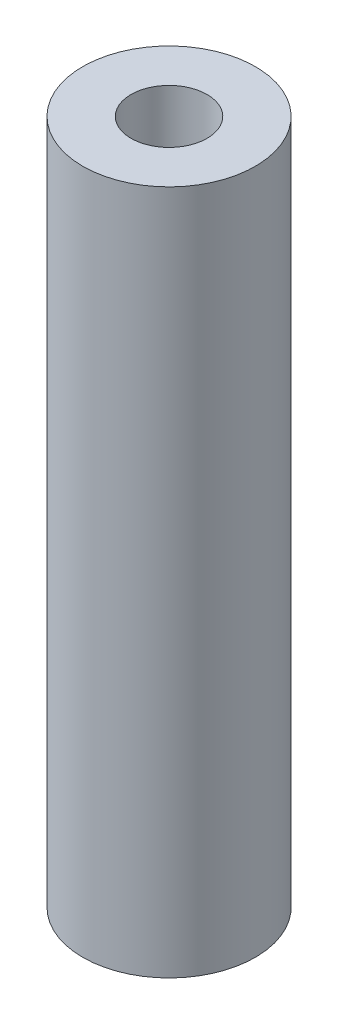
ISO-10303-21;
HEADER;
FILE_DESCRIPTION(('STEP AP214'),'2;1');
FILE_NAME('part.step','',(''),(''),'','','');
FILE_SCHEMA(('AUTOMOTIVE_DESIGN { 1 0 10303 214 1 1 1 1 }'));
ENDSEC;
DATA;
#1=APPLICATION_CONTEXT('core data for automotive mechanical design processes');
#2=APPLICATION_PROTOCOL_DEFINITION('international standard','automotive_design',2000,#1);
#3=PRODUCT_CONTEXT('',#1,'mechanical');
#4=PRODUCT('Part','Part','',(#3));
#5=PRODUCT_RELATED_PRODUCT_CATEGORY('part','',(#4));
#6=PRODUCT_DEFINITION_FORMATION('','',#4);
#7=PRODUCT_DEFINITION_CONTEXT('part definition',#1,'design');
#8=PRODUCT_DEFINITION('design','',#6,#7);
#9=PRODUCT_DEFINITION_SHAPE('','',#8);
#10=(LENGTH_UNIT() NAMED_UNIT(*) SI_UNIT(.MILLI.,.METRE.));
#11=(NAMED_UNIT(*) PLANE_ANGLE_UNIT() SI_UNIT($,.RADIAN.));
#12=(NAMED_UNIT(*) SI_UNIT($,.STERADIAN.) SOLID_ANGLE_UNIT());
#13=UNCERTAINTY_MEASURE_WITH_UNIT(LENGTH_MEASURE(1.E-05),#10,'distance_accuracy_value','');
#14=(GEOMETRIC_REPRESENTATION_CONTEXT(3) GLOBAL_UNCERTAINTY_ASSIGNED_CONTEXT((#13)) GLOBAL_UNIT_ASSIGNED_CONTEXT((#10,
#11,#12)) REPRESENTATION_CONTEXT('',''));
#15=CARTESIAN_POINT('',(0.,0.,0.));
#16=DIRECTION('',(0.,0.,1.));
#17=DIRECTION('',(1.,0.,0.));
#18=AXIS2_PLACEMENT_3D('',#15,#16,#17);
#19=CARTESIAN_POINT('',(0.,25.4,0.));
#20=DIRECTION('',(0.,-1.,0.));
#21=DIRECTION('',(0.,0.,-1.));
#22=AXIS2_PLACEMENT_3D('',#19,#20,#21);
#23=CYLINDRICAL_SURFACE('',#22,3.2004);
#24=CARTESIAN_POINT('',(0.,25.4,0.));
#25=DIRECTION('',(0.,1.,0.));
#26=DIRECTION('',(0.,0.,1.));
#27=AXIS2_PLACEMENT_3D('',#24,#25,#26);
#28=CIRCLE('',#27,3.2004);
#29=CARTESIAN_POINT('',(0.,25.4,3.2004));
#30=VERTEX_POINT('',#29);
#31=EDGE_CURVE('E10',#30,#30,#28,.T.);
#32=ORIENTED_EDGE('',*,*,#31,.F.);
#33=EDGE_LOOP('',(#32));
#34=FACE_BOUND('',#33,.T.);
#35=CARTESIAN_POINT('',(0.,0.,0.));
#36=DIRECTION('',(0.,1.,0.));
#37=DIRECTION('',(0.,0.,1.));
#38=AXIS2_PLACEMENT_3D('',#35,#36,#37);
#39=CIRCLE('',#38,3.2004);
#40=CARTESIAN_POINT('',(0.,0.,3.2004));
#41=VERTEX_POINT('',#40);
#42=EDGE_CURVE('E35',#41,#41,#39,.T.);
#43=ORIENTED_EDGE('',*,*,#42,.T.);
#44=EDGE_LOOP('',(#43));
#45=FACE_BOUND('',#44,.T.);
#46=ADVANCED_FACE('F32',(#34,#45),#23,.T.);
#47=CARTESIAN_POINT('',(0.,25.4,0.));
#48=DIRECTION('',(0.,1.,0.));
#49=DIRECTION('',(0.,0.,1.));
#50=AXIS2_PLACEMENT_3D('',#47,#48,#49);
#51=PLANE('',#50);
#52=CARTESIAN_POINT('',(0.,25.4,0.));
#53=DIRECTION('',(0.,-1.,0.));
#54=DIRECTION('',(0.,0.,-1.));
#55=AXIS2_PLACEMENT_3D('',#52,#53,#54);
#56=CIRCLE('',#55,1.40969999999999);
#57=CARTESIAN_POINT('',(0.,25.4,-1.40969999999999));
#58=VERTEX_POINT('',#57);
#59=EDGE_CURVE('E42',#58,#58,#56,.T.);
#60=ORIENTED_EDGE('',*,*,#59,.T.);
#61=EDGE_LOOP('',(#60));
#62=FACE_BOUND('',#61,.T.);
#63=ORIENTED_EDGE('',*,*,#31,.T.);
#64=EDGE_LOOP('',(#63));
#65=FACE_BOUND('',#64,.T.);
#66=ADVANCED_FACE('F55',(#62,#65),#51,.T.);
#67=CARTESIAN_POINT('',(0.,0.,0.));
#68=DIRECTION('',(0.,1.,0.));
#69=DIRECTION('',(0.,0.,1.));
#70=AXIS2_PLACEMENT_3D('',#67,#68,#69);
#71=PLANE('',#70);
#72=CARTESIAN_POINT('',(0.,0.,0.));
#73=DIRECTION('',(0.,-1.,0.));
#74=DIRECTION('',(0.,0.,-1.));
#75=AXIS2_PLACEMENT_3D('',#72,#73,#74);
#76=CIRCLE('',#75,1.40969999999999);
#77=CARTESIAN_POINT('',(0.,0.,-1.40969999999999));
#78=VERTEX_POINT('',#77);
#79=EDGE_CURVE('E46',#78,#78,#76,.T.);
#80=ORIENTED_EDGE('',*,*,#79,.F.);
#81=EDGE_LOOP('',(#80));
#82=FACE_BOUND('',#81,.T.);
#83=ORIENTED_EDGE('',*,*,#42,.F.);
#84=EDGE_LOOP('',(#83));
#85=FACE_BOUND('',#84,.T.);
#86=ADVANCED_FACE('F52',(#82,#85),#71,.F.);
#87=CARTESIAN_POINT('',(0.,0.,0.));
#88=DIRECTION('',(0.,-1.,0.));
#89=DIRECTION('',(0.,0.,-1.));
#90=AXIS2_PLACEMENT_3D('',#87,#88,#89);
#91=CYLINDRICAL_SURFACE('',#90,1.40969999999999);
#92=ORIENTED_EDGE('',*,*,#59,.F.);
#93=EDGE_LOOP('',(#92));
#94=FACE_BOUND('',#93,.T.);
#95=ORIENTED_EDGE('',*,*,#79,.T.);
#96=EDGE_LOOP('',(#95));
#97=FACE_BOUND('',#96,.T.);
#98=ADVANCED_FACE('F50',(#94,#97),#91,.F.);
#99=CLOSED_SHELL('',(#46,#66,#86,#98));
#100=MANIFOLD_SOLID_BREP('B2',#99);
#101=ADVANCED_BREP_SHAPE_REPRESENTATION('',(#18,#100),#14);
#102=SHAPE_DEFINITION_REPRESENTATION(#9,#101);
ENDSEC;
END-ISO-10303-21;
